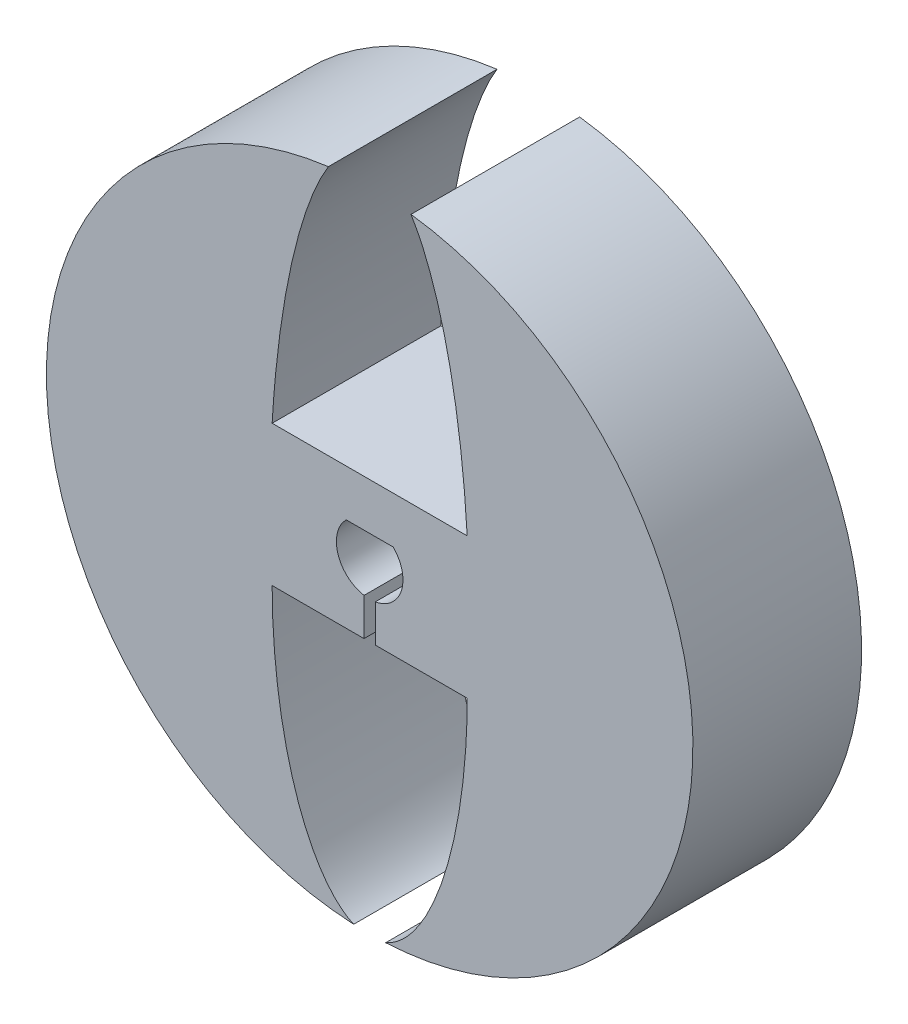
ISO-10303-21;
HEADER;
FILE_DESCRIPTION(('STEP AP214'),'2;1');
FILE_NAME('part.step','',(''),(''),'','','');
FILE_SCHEMA(('AUTOMOTIVE_DESIGN { 1 0 10303 214 1 1 1 1 }'));
ENDSEC;
DATA;
#1=APPLICATION_CONTEXT('core data for automotive mechanical design processes');
#2=APPLICATION_PROTOCOL_DEFINITION('international standard','automotive_design',2000,#1);
#3=PRODUCT_CONTEXT('',#1,'mechanical');
#4=PRODUCT('Part','Part','',(#3));
#5=PRODUCT_RELATED_PRODUCT_CATEGORY('part','',(#4));
#6=PRODUCT_DEFINITION_FORMATION('','',#4);
#7=PRODUCT_DEFINITION_CONTEXT('part definition',#1,'design');
#8=PRODUCT_DEFINITION('design','',#6,#7);
#9=PRODUCT_DEFINITION_SHAPE('','',#8);
#10=(LENGTH_UNIT() NAMED_UNIT(*) SI_UNIT(.MILLI.,.METRE.));
#11=(NAMED_UNIT(*) PLANE_ANGLE_UNIT() SI_UNIT($,.RADIAN.));
#12=(NAMED_UNIT(*) SI_UNIT($,.STERADIAN.) SOLID_ANGLE_UNIT());
#13=UNCERTAINTY_MEASURE_WITH_UNIT(LENGTH_MEASURE(1.E-05),#10,'distance_accuracy_value','');
#14=(GEOMETRIC_REPRESENTATION_CONTEXT(3) GLOBAL_UNCERTAINTY_ASSIGNED_CONTEXT((#13)) GLOBAL_UNIT_ASSIGNED_CONTEXT((#10,
#11,#12)) REPRESENTATION_CONTEXT('',''));
#15=CARTESIAN_POINT('',(0.,0.,0.));
#16=DIRECTION('',(0.,0.,1.));
#17=DIRECTION('',(1.,0.,0.));
#18=AXIS2_PLACEMENT_3D('',#15,#16,#17);
#19=CARTESIAN_POINT('',(0.,0.,12.));
#20=DIRECTION('',(0.,0.,-1.));
#21=DIRECTION('',(-1.,0.,0.));
#22=AXIS2_PLACEMENT_3D('',#19,#20,#21);
#23=CYLINDRICAL_SURFACE('',#22,23.);
#24=CARTESIAN_POINT('',(0.,0.,0.));
#25=DIRECTION('',(0.,0.,1.));
#26=DIRECTION('',(1.,0.,0.));
#27=AXIS2_PLACEMENT_3D('',#24,#25,#26);
#28=CIRCLE('',#27,23.);
#29=CARTESIAN_POINT('',(1.13686897646394,-22.9718856198257,0.));
#30=VERTEX_POINT('',#29);
#31=CARTESIAN_POINT('',(2.93993236520978,22.8113304672917,0.));
#32=VERTEX_POINT('',#31);
#33=EDGE_CURVE('E158',#30,#32,#28,.T.);
#34=ORIENTED_EDGE('',*,*,#33,.T.);
#35=DIRECTION('',(0.,0.,1.));
#36=VECTOR('',#35,1.);
#37=CARTESIAN_POINT('',(2.93993236520978,22.8113304672917,0.));
#38=LINE('',#37,#36);
#39=CARTESIAN_POINT('',(2.93993236520978,22.8113304672917,12.));
#40=VERTEX_POINT('',#39);
#41=EDGE_CURVE('E199',#32,#40,#38,.T.);
#42=ORIENTED_EDGE('',*,*,#41,.T.);
#43=CARTESIAN_POINT('',(0.,0.,12.));
#44=DIRECTION('',(0.,0.,1.));
#45=DIRECTION('',(1.,0.,0.));
#46=AXIS2_PLACEMENT_3D('',#43,#44,#45);
#47=CIRCLE('',#46,23.);
#48=CARTESIAN_POINT('',(1.13686897646394,-22.9718856198257,12.));
#49=VERTEX_POINT('',#48);
#50=EDGE_CURVE('E166',#49,#40,#47,.T.);
#51=ORIENTED_EDGE('',*,*,#50,.F.);
#52=DIRECTION('',(0.,0.,1.));
#53=VECTOR('',#52,1.);
#54=CARTESIAN_POINT('',(1.13686897646394,-22.9718856198257,0.));
#55=LINE('',#54,#53);
#56=EDGE_CURVE('E163',#49,#30,#55,.F.);
#57=ORIENTED_EDGE('',*,*,#56,.T.);
#58=EDGE_LOOP('',(#34,#42,#51,#57));
#59=FACE_BOUND('',#58,.T.);
#60=ADVANCED_FACE('F32',(#59),#23,.T.);
#61=CARTESIAN_POINT('',(-2.93993236520978,22.8113304672917,12.));
#62=VERTEX_POINT('',#61);
#63=CARTESIAN_POINT('',(-1.13686897646395,-22.9718856198257,12.));
#64=VERTEX_POINT('',#63);
#65=EDGE_CURVE('E162',#62,#64,#47,.T.);
#66=ORIENTED_EDGE('',*,*,#65,.F.);
#67=DIRECTION('',(0.,0.,1.));
#68=VECTOR('',#67,1.);
#69=CARTESIAN_POINT('',(-2.93993236520978,22.8113304672917,0.));
#70=LINE('',#69,#68);
#71=CARTESIAN_POINT('',(-2.93993236520978,22.8113304672917,0.));
#72=VERTEX_POINT('',#71);
#73=EDGE_CURVE('E406',#62,#72,#70,.F.);
#74=ORIENTED_EDGE('',*,*,#73,.T.);
#75=CARTESIAN_POINT('',(-1.13686897646395,-22.9718856198257,0.));
#76=VERTEX_POINT('',#75);
#77=EDGE_CURVE('E151',#72,#76,#28,.T.);
#78=ORIENTED_EDGE('',*,*,#77,.T.);
#79=DIRECTION('',(0.,0.,1.));
#80=VECTOR('',#79,1.);
#81=CARTESIAN_POINT('',(-1.13686897646395,-22.9718856198257,0.));
#82=LINE('',#81,#80);
#83=EDGE_CURVE('E159',#76,#64,#82,.T.);
#84=ORIENTED_EDGE('',*,*,#83,.T.);
#85=EDGE_LOOP('',(#66,#74,#78,#84));
#86=FACE_BOUND('',#85,.T.);
#87=ADVANCED_FACE('F34',(#86),#23,.T.);
#88=CARTESIAN_POINT('',(0.,0.,12.));
#89=DIRECTION('',(0.,0.,1.));
#90=DIRECTION('',(1.,0.,0.));
#91=AXIS2_PLACEMENT_3D('',#88,#89,#90);
#92=PLANE('',#91);
#93=CARTESIAN_POINT('',(0.,0.,12.));
#94=DIRECTION('',(0.,0.,1.));
#95=DIRECTION('',(0.,1.,0.));
#96=AXIS2_PLACEMENT_3D('',#93,#94,#95);
#97=ELLIPSE('',#96,25.0741956065991,7.08162428219852);
#98=CARTESIAN_POINT('',(-6.93940057551877,5.,12.));
#99=VERTEX_POINT('',#98);
#100=EDGE_CURVE('E137',#62,#99,#97,.T.);
#101=ORIENTED_EDGE('',*,*,#100,.F.);
#102=ORIENTED_EDGE('',*,*,#65,.T.);
#103=CARTESIAN_POINT('',(0.,-5.,12.));
#104=DIRECTION('',(0.,0.,1.));
#105=DIRECTION('',(0.,1.,0.));
#106=AXIS2_PLACEMENT_3D('',#103,#104,#105);
#107=ELLIPSE('',#106,18.2180312991267,6.93940057551877);
#108=CARTESIAN_POINT('',(-6.93940057551877,-5.,12.));
#109=VERTEX_POINT('',#108);
#110=EDGE_CURVE('E180',#109,#64,#107,.T.);
#111=ORIENTED_EDGE('',*,*,#110,.F.);
#112=DIRECTION('',(-1.,0.,0.));
#113=VECTOR('',#112,1.);
#114=CARTESIAN_POINT('',(-6.93940057551877,-5.,12.));
#115=LINE('',#114,#113);
#116=CARTESIAN_POINT('',(-0.399999999999998,-5.,12.));
#117=VERTEX_POINT('',#116);
#118=EDGE_CURVE('E250',#117,#109,#115,.T.);
#119=ORIENTED_EDGE('',*,*,#118,.F.);
#120=DIRECTION('',(0.,-1.,0.));
#121=VECTOR('',#120,1.);
#122=CARTESIAN_POINT('',(-0.399999999999998,-5.,12.));
#123=LINE('',#122,#121);
#124=CARTESIAN_POINT('',(-0.399999999999999,-2.33600085616423,12.));
#125=VERTEX_POINT('',#124);
#126=EDGE_CURVE('E247',#125,#117,#123,.T.);
#127=ORIENTED_EDGE('',*,*,#126,.F.);
#128=CARTESIAN_POINT('',(0.,0.,12.));
#129=DIRECTION('',(0.,0.,1.));
#130=DIRECTION('',(1.,0.,0.));
#131=AXIS2_PLACEMENT_3D('',#128,#129,#130);
#132=CIRCLE('',#131,2.37);
#133=CARTESIAN_POINT('',(-1.66966343913976,1.682,12.));
#134=VERTEX_POINT('',#133);
#135=EDGE_CURVE('E244',#134,#125,#132,.T.);
#136=ORIENTED_EDGE('',*,*,#135,.F.);
#137=DIRECTION('',(-1.,0.,0.));
#138=VECTOR('',#137,1.);
#139=CARTESIAN_POINT('',(-1.66966343913976,1.682,12.));
#140=LINE('',#139,#138);
#141=CARTESIAN_POINT('',(1.66966343913976,1.682,12.));
#142=VERTEX_POINT('',#141);
#143=EDGE_CURVE('E241',#142,#134,#140,.T.);
#144=ORIENTED_EDGE('',*,*,#143,.F.);
#145=CARTESIAN_POINT('',(0.,0.,12.));
#146=DIRECTION('',(0.,0.,1.));
#147=DIRECTION('',(1.,0.,0.));
#148=AXIS2_PLACEMENT_3D('',#145,#146,#147);
#149=CIRCLE('',#148,2.37);
#150=CARTESIAN_POINT('',(0.399999999999999,-2.33600085616423,12.));
#151=VERTEX_POINT('',#150);
#152=EDGE_CURVE('E238',#151,#142,#149,.T.);
#153=ORIENTED_EDGE('',*,*,#152,.F.);
#154=DIRECTION('',(0.,1.,0.));
#155=VECTOR('',#154,1.);
#156=CARTESIAN_POINT('',(0.399999999999998,-5.,12.));
#157=LINE('',#156,#155);
#158=CARTESIAN_POINT('',(0.399999999999998,-5.,12.));
#159=VERTEX_POINT('',#158);
#160=EDGE_CURVE('E254',#159,#151,#157,.T.);
#161=ORIENTED_EDGE('',*,*,#160,.F.);
#162=DIRECTION('',(-1.,0.,0.));
#163=VECTOR('',#162,1.);
#164=CARTESIAN_POINT('',(0.399999999999998,-5.,12.));
#165=LINE('',#164,#163);
#166=CARTESIAN_POINT('',(6.93940057551877,-5.,12.));
#167=VERTEX_POINT('',#166);
#168=EDGE_CURVE('E185',#167,#159,#165,.T.);
#169=ORIENTED_EDGE('',*,*,#168,.F.);
#170=EDGE_CURVE('E186',#49,#167,#107,.T.);
#171=ORIENTED_EDGE('',*,*,#170,.F.);
#172=ORIENTED_EDGE('',*,*,#50,.T.);
#173=CARTESIAN_POINT('',(6.93940057551877,5.,12.));
#174=VERTEX_POINT('',#173);
#175=EDGE_CURVE('E202',#174,#40,#97,.T.);
#176=ORIENTED_EDGE('',*,*,#175,.F.);
#177=DIRECTION('',(1.,0.,0.));
#178=VECTOR('',#177,1.);
#179=CARTESIAN_POINT('',(-6.93940057551877,5.,12.));
#180=LINE('',#179,#178);
#181=EDGE_CURVE('E200',#99,#174,#180,.T.);
#182=ORIENTED_EDGE('',*,*,#181,.F.);
#183=EDGE_LOOP('',(#101,#102,#111,#119,#127,#136,#144,#153,#161,#169,#171,#172,#176,#182));
#184=FACE_BOUND('',#183,.T.);
#185=ADVANCED_FACE('F178',(#184),#92,.T.);
#186=CARTESIAN_POINT('',(0.,0.,0.));
#187=DIRECTION('',(0.,0.,1.));
#188=DIRECTION('',(1.,0.,0.));
#189=AXIS2_PLACEMENT_3D('',#186,#187,#188);
#190=PLANE('',#189);
#191=ORIENTED_EDGE('',*,*,#77,.F.);
#192=CARTESIAN_POINT('',(0.,0.,0.));
#193=DIRECTION('',(0.,0.,1.));
#194=DIRECTION('',(0.,1.,0.));
#195=AXIS2_PLACEMENT_3D('',#192,#193,#194);
#196=ELLIPSE('',#195,25.0741956065991,7.08162428219852);
#197=CARTESIAN_POINT('',(-6.93940057551877,5.,0.));
#198=VERTEX_POINT('',#197);
#199=EDGE_CURVE('E11',#72,#198,#196,.T.);
#200=ORIENTED_EDGE('',*,*,#199,.T.);
#201=DIRECTION('',(1.,0.,0.));
#202=VECTOR('',#201,1.);
#203=CARTESIAN_POINT('',(-6.93940057551877,5.,0.));
#204=LINE('',#203,#202);
#205=CARTESIAN_POINT('',(6.93940057551877,5.,0.));
#206=VERTEX_POINT('',#205);
#207=EDGE_CURVE('E142',#198,#206,#204,.T.);
#208=ORIENTED_EDGE('',*,*,#207,.T.);
#209=CARTESIAN_POINT('',(0.,0.,0.));
#210=DIRECTION('',(0.,0.,1.));
#211=DIRECTION('',(0.,1.,0.));
#212=AXIS2_PLACEMENT_3D('',#209,#210,#211);
#213=ELLIPSE('',#212,25.0741956065991,7.08162428219852);
#214=EDGE_CURVE('E47',#206,#32,#213,.T.);
#215=ORIENTED_EDGE('',*,*,#214,.T.);
#216=ORIENTED_EDGE('',*,*,#33,.F.);
#217=CARTESIAN_POINT('',(0.,-5.,0.));
#218=DIRECTION('',(0.,0.,1.));
#219=DIRECTION('',(0.,1.,0.));
#220=AXIS2_PLACEMENT_3D('',#217,#218,#219);
#221=ELLIPSE('',#220,18.2180312991267,6.93940057551877);
#222=CARTESIAN_POINT('',(6.93940057551877,-5.,0.));
#223=VERTEX_POINT('',#222);
#224=EDGE_CURVE('E40',#30,#223,#221,.T.);
#225=ORIENTED_EDGE('',*,*,#224,.T.);
#226=DIRECTION('',(-1.,0.,0.));
#227=VECTOR('',#226,1.);
#228=CARTESIAN_POINT('',(0.399999999999998,-5.,0.));
#229=LINE('',#228,#227);
#230=CARTESIAN_POINT('',(0.399999999999998,-5.,0.));
#231=VERTEX_POINT('',#230);
#232=EDGE_CURVE('E230',#223,#231,#229,.T.);
#233=ORIENTED_EDGE('',*,*,#232,.T.);
#234=DIRECTION('',(0.,1.,0.));
#235=VECTOR('',#234,1.);
#236=CARTESIAN_POINT('',(0.399999999999998,-5.,0.));
#237=LINE('',#236,#235);
#238=CARTESIAN_POINT('',(0.399999999999999,-2.33600085616423,0.));
#239=VERTEX_POINT('',#238);
#240=EDGE_CURVE('E234',#231,#239,#237,.T.);
#241=ORIENTED_EDGE('',*,*,#240,.T.);
#242=CARTESIAN_POINT('',(0.,0.,0.));
#243=DIRECTION('',(0.,0.,1.));
#244=DIRECTION('',(1.,0.,0.));
#245=AXIS2_PLACEMENT_3D('',#242,#243,#244);
#246=CIRCLE('',#245,2.37);
#247=CARTESIAN_POINT('',(1.66966343913976,1.682,0.));
#248=VERTEX_POINT('',#247);
#249=EDGE_CURVE('E257',#239,#248,#246,.T.);
#250=ORIENTED_EDGE('',*,*,#249,.T.);
#251=DIRECTION('',(-1.,0.,0.));
#252=VECTOR('',#251,1.);
#253=CARTESIAN_POINT('',(-1.66966343913976,1.682,0.));
#254=LINE('',#253,#252);
#255=CARTESIAN_POINT('',(-1.66966343913976,1.682,0.));
#256=VERTEX_POINT('',#255);
#257=EDGE_CURVE('E278',#248,#256,#254,.T.);
#258=ORIENTED_EDGE('',*,*,#257,.T.);
#259=CARTESIAN_POINT('',(0.,0.,0.));
#260=DIRECTION('',(0.,0.,1.));
#261=DIRECTION('',(1.,0.,0.));
#262=AXIS2_PLACEMENT_3D('',#259,#260,#261);
#263=CIRCLE('',#262,2.37);
#264=CARTESIAN_POINT('',(-0.399999999999999,-2.33600085616423,0.));
#265=VERTEX_POINT('',#264);
#266=EDGE_CURVE('E55',#256,#265,#263,.T.);
#267=ORIENTED_EDGE('',*,*,#266,.T.);
#268=DIRECTION('',(0.,-1.,0.));
#269=VECTOR('',#268,1.);
#270=CARTESIAN_POINT('',(-0.399999999999998,-5.,0.));
#271=LINE('',#270,#269);
#272=CARTESIAN_POINT('',(-0.399999999999998,-5.,0.));
#273=VERTEX_POINT('',#272);
#274=EDGE_CURVE('E289',#265,#273,#271,.T.);
#275=ORIENTED_EDGE('',*,*,#274,.T.);
#276=DIRECTION('',(-1.,0.,0.));
#277=VECTOR('',#276,1.);
#278=CARTESIAN_POINT('',(-6.93940057551877,-5.,0.));
#279=LINE('',#278,#277);
#280=CARTESIAN_POINT('',(-6.93940057551877,-5.,0.));
#281=VERTEX_POINT('',#280);
#282=EDGE_CURVE('E231',#273,#281,#279,.T.);
#283=ORIENTED_EDGE('',*,*,#282,.T.);
#284=CARTESIAN_POINT('',(0.,-5.,0.));
#285=DIRECTION('',(0.,0.,1.));
#286=DIRECTION('',(0.,1.,0.));
#287=AXIS2_PLACEMENT_3D('',#284,#285,#286);
#288=ELLIPSE('',#287,18.2180312991267,6.93940057551877);
#289=EDGE_CURVE('E154',#281,#76,#288,.T.);
#290=ORIENTED_EDGE('',*,*,#289,.T.);
#291=EDGE_LOOP('',(#191,#200,#208,#215,#216,#225,#233,#241,#250,#258,#267,#275,#283,#290));
#292=FACE_BOUND('',#291,.T.);
#293=ADVANCED_FACE('F149',(#292),#190,.F.);
#294=DIRECTION('',(0.,0.,1.));
#295=VECTOR('',#294,1.);
#296=SURFACE_OF_LINEAR_EXTRUSION('',#288,#295);
#297=ORIENTED_EDGE('',*,*,#289,.F.);
#298=DIRECTION('',(0.,0.,1.));
#299=VECTOR('',#298,1.);
#300=CARTESIAN_POINT('',(-6.93940057551877,-5.,0.));
#301=LINE('',#300,#299);
#302=EDGE_CURVE('E183',#281,#109,#301,.T.);
#303=ORIENTED_EDGE('',*,*,#302,.T.);
#304=ORIENTED_EDGE('',*,*,#110,.T.);
#305=ORIENTED_EDGE('',*,*,#83,.F.);
#306=EDGE_LOOP('',(#297,#303,#304,#305));
#307=FACE_BOUND('',#306,.T.);
#308=ADVANCED_FACE('F182',(#307),#296,.F.);
#309=ORIENTED_EDGE('',*,*,#170,.T.);
#310=DIRECTION('',(0.,0.,1.));
#311=VECTOR('',#310,1.);
#312=CARTESIAN_POINT('',(6.93940057551877,-5.,0.));
#313=LINE('',#312,#311);
#314=EDGE_CURVE('E262',#223,#167,#313,.T.);
#315=ORIENTED_EDGE('',*,*,#314,.F.);
#316=ORIENTED_EDGE('',*,*,#224,.F.);
#317=ORIENTED_EDGE('',*,*,#56,.F.);
#318=EDGE_LOOP('',(#309,#315,#316,#317));
#319=FACE_BOUND('',#318,.T.);
#320=ADVANCED_FACE('F225',(#319),#296,.F.);
#321=CARTESIAN_POINT('',(0.,0.,0.));
#322=DIRECTION('',(0.,0.,1.));
#323=DIRECTION('',(1.,0.,0.));
#324=AXIS2_PLACEMENT_3D('',#321,#322,#323);
#325=CYLINDRICAL_SURFACE('',#324,2.37);
#326=ORIENTED_EDGE('',*,*,#152,.T.);
#327=DIRECTION('',(0.,0.,1.));
#328=VECTOR('',#327,1.);
#329=CARTESIAN_POINT('',(1.66966343913976,1.682,0.));
#330=LINE('',#329,#328);
#331=EDGE_CURVE('E237',#248,#142,#330,.T.);
#332=ORIENTED_EDGE('',*,*,#331,.F.);
#333=ORIENTED_EDGE('',*,*,#249,.F.);
#334=DIRECTION('',(0.,0.,1.));
#335=VECTOR('',#334,1.);
#336=CARTESIAN_POINT('',(0.399999999999999,-2.33600085616423,0.));
#337=LINE('',#336,#335);
#338=EDGE_CURVE('E258',#239,#151,#337,.T.);
#339=ORIENTED_EDGE('',*,*,#338,.T.);
#340=EDGE_LOOP('',(#326,#332,#333,#339));
#341=FACE_BOUND('',#340,.T.);
#342=ADVANCED_FACE('F216',(#341),#325,.F.);
#343=CARTESIAN_POINT('',(0.399999999999998,-5.,0.));
#344=DIRECTION('',(1.,0.,0.));
#345=DIRECTION('',(0.,1.,0.));
#346=AXIS2_PLACEMENT_3D('',#343,#344,#345);
#347=PLANE('',#346);
#348=ORIENTED_EDGE('',*,*,#160,.T.);
#349=ORIENTED_EDGE('',*,*,#338,.F.);
#350=ORIENTED_EDGE('',*,*,#240,.F.);
#351=DIRECTION('',(0.,0.,1.));
#352=VECTOR('',#351,1.);
#353=CARTESIAN_POINT('',(0.399999999999998,-5.,0.));
#354=LINE('',#353,#352);
#355=EDGE_CURVE('E260',#231,#159,#354,.T.);
#356=ORIENTED_EDGE('',*,*,#355,.T.);
#357=EDGE_LOOP('',(#348,#349,#350,#356));
#358=FACE_BOUND('',#357,.T.);
#359=ADVANCED_FACE('F212',(#358),#347,.F.);
#360=CARTESIAN_POINT('',(0.399999999999998,-5.,0.));
#361=DIRECTION('',(0.,1.,0.));
#362=DIRECTION('',(0.,0.,1.));
#363=AXIS2_PLACEMENT_3D('',#360,#361,#362);
#364=PLANE('',#363);
#365=ORIENTED_EDGE('',*,*,#168,.T.);
#366=ORIENTED_EDGE('',*,*,#355,.F.);
#367=ORIENTED_EDGE('',*,*,#232,.F.);
#368=ORIENTED_EDGE('',*,*,#314,.T.);
#369=EDGE_LOOP('',(#365,#366,#367,#368));
#370=FACE_BOUND('',#369,.T.);
#371=ADVANCED_FACE('F215',(#370),#364,.F.);
#372=CARTESIAN_POINT('',(-6.93940057551877,-5.,0.));
#373=DIRECTION('',(0.,1.,0.));
#374=DIRECTION('',(0.,0.,1.));
#375=AXIS2_PLACEMENT_3D('',#372,#373,#374);
#376=PLANE('',#375);
#377=ORIENTED_EDGE('',*,*,#118,.T.);
#378=ORIENTED_EDGE('',*,*,#302,.F.);
#379=ORIENTED_EDGE('',*,*,#282,.F.);
#380=DIRECTION('',(0.,0.,1.));
#381=VECTOR('',#380,1.);
#382=CARTESIAN_POINT('',(-0.399999999999998,-5.,0.));
#383=LINE('',#382,#381);
#384=EDGE_CURVE('E266',#273,#117,#383,.T.);
#385=ORIENTED_EDGE('',*,*,#384,.T.);
#386=EDGE_LOOP('',(#377,#378,#379,#385));
#387=FACE_BOUND('',#386,.T.);
#388=ADVANCED_FACE('F220',(#387),#376,.F.);
#389=CARTESIAN_POINT('',(-0.399999999999998,-5.,0.));
#390=DIRECTION('',(-1.,0.,0.));
#391=DIRECTION('',(0.,-1.,0.));
#392=AXIS2_PLACEMENT_3D('',#389,#390,#391);
#393=PLANE('',#392);
#394=ORIENTED_EDGE('',*,*,#126,.T.);
#395=ORIENTED_EDGE('',*,*,#384,.F.);
#396=ORIENTED_EDGE('',*,*,#274,.F.);
#397=DIRECTION('',(0.,0.,1.));
#398=VECTOR('',#397,1.);
#399=CARTESIAN_POINT('',(-0.399999999999999,-2.33600085616423,0.));
#400=LINE('',#399,#398);
#401=EDGE_CURVE('E268',#265,#125,#400,.T.);
#402=ORIENTED_EDGE('',*,*,#401,.T.);
#403=EDGE_LOOP('',(#394,#395,#396,#402));
#404=FACE_BOUND('',#403,.T.);
#405=ADVANCED_FACE('F296',(#404),#393,.F.);
#406=CARTESIAN_POINT('',(0.,0.,0.));
#407=DIRECTION('',(0.,0.,1.));
#408=DIRECTION('',(1.,0.,0.));
#409=AXIS2_PLACEMENT_3D('',#406,#407,#408);
#410=CYLINDRICAL_SURFACE('',#409,2.37);
#411=ORIENTED_EDGE('',*,*,#135,.T.);
#412=ORIENTED_EDGE('',*,*,#401,.F.);
#413=ORIENTED_EDGE('',*,*,#266,.F.);
#414=DIRECTION('',(0.,0.,1.));
#415=VECTOR('',#414,1.);
#416=CARTESIAN_POINT('',(-1.66966343913976,1.682,0.));
#417=LINE('',#416,#415);
#418=EDGE_CURVE('E270',#256,#134,#417,.T.);
#419=ORIENTED_EDGE('',*,*,#418,.T.);
#420=EDGE_LOOP('',(#411,#412,#413,#419));
#421=FACE_BOUND('',#420,.T.);
#422=ADVANCED_FACE('F285',(#421),#410,.F.);
#423=CARTESIAN_POINT('',(-1.66966343913976,1.682,0.));
#424=DIRECTION('',(0.,1.,0.));
#425=DIRECTION('',(0.,0.,1.));
#426=AXIS2_PLACEMENT_3D('',#423,#424,#425);
#427=PLANE('',#426);
#428=ORIENTED_EDGE('',*,*,#143,.T.);
#429=ORIENTED_EDGE('',*,*,#418,.F.);
#430=ORIENTED_EDGE('',*,*,#257,.F.);
#431=ORIENTED_EDGE('',*,*,#331,.T.);
#432=EDGE_LOOP('',(#428,#429,#430,#431));
#433=FACE_BOUND('',#432,.T.);
#434=ADVANCED_FACE('F211',(#433),#427,.F.);
#435=DIRECTION('',(0.,0.,1.));
#436=VECTOR('',#435,1.);
#437=SURFACE_OF_LINEAR_EXTRUSION('',#213,#436);
#438=ORIENTED_EDGE('',*,*,#214,.F.);
#439=DIRECTION('',(0.,0.,1.));
#440=VECTOR('',#439,1.);
#441=CARTESIAN_POINT('',(6.93940057551877,5.,0.));
#442=LINE('',#441,#440);
#443=EDGE_CURVE('E141',#206,#174,#442,.T.);
#444=ORIENTED_EDGE('',*,*,#443,.T.);
#445=ORIENTED_EDGE('',*,*,#175,.T.);
#446=ORIENTED_EDGE('',*,*,#41,.F.);
#447=EDGE_LOOP('',(#438,#444,#445,#446));
#448=FACE_BOUND('',#447,.T.);
#449=ADVANCED_FACE('F207',(#448),#437,.F.);
#450=ORIENTED_EDGE('',*,*,#100,.T.);
#451=DIRECTION('',(0.,0.,1.));
#452=VECTOR('',#451,1.);
#453=CARTESIAN_POINT('',(-6.93940057551877,5.,0.));
#454=LINE('',#453,#452);
#455=EDGE_CURVE('E132',#198,#99,#454,.T.);
#456=ORIENTED_EDGE('',*,*,#455,.F.);
#457=ORIENTED_EDGE('',*,*,#199,.F.);
#458=ORIENTED_EDGE('',*,*,#73,.F.);
#459=EDGE_LOOP('',(#450,#456,#457,#458));
#460=FACE_BOUND('',#459,.T.);
#461=ADVANCED_FACE('F134',(#460),#437,.F.);
#462=CARTESIAN_POINT('',(-6.93940057551877,5.,0.));
#463=DIRECTION('',(0.,-1.,0.));
#464=DIRECTION('',(0.,0.,-1.));
#465=AXIS2_PLACEMENT_3D('',#462,#463,#464);
#466=PLANE('',#465);
#467=ORIENTED_EDGE('',*,*,#181,.T.);
#468=ORIENTED_EDGE('',*,*,#443,.F.);
#469=ORIENTED_EDGE('',*,*,#207,.F.);
#470=ORIENTED_EDGE('',*,*,#455,.T.);
#471=EDGE_LOOP('',(#467,#468,#469,#470));
#472=FACE_BOUND('',#471,.T.);
#473=ADVANCED_FACE('F145',(#472),#466,.F.);
#474=CLOSED_SHELL('',(#60,#87,#185,#293,#308,#320,#342,#359,#371,#388,#405,#422,#434,#449,#461,#473));
#475=MANIFOLD_SOLID_BREP('B2',#474);
#476=ADVANCED_BREP_SHAPE_REPRESENTATION('',(#18,#475),#14);
#477=SHAPE_DEFINITION_REPRESENTATION(#9,#476);
ENDSEC;
END-ISO-10303-21;
